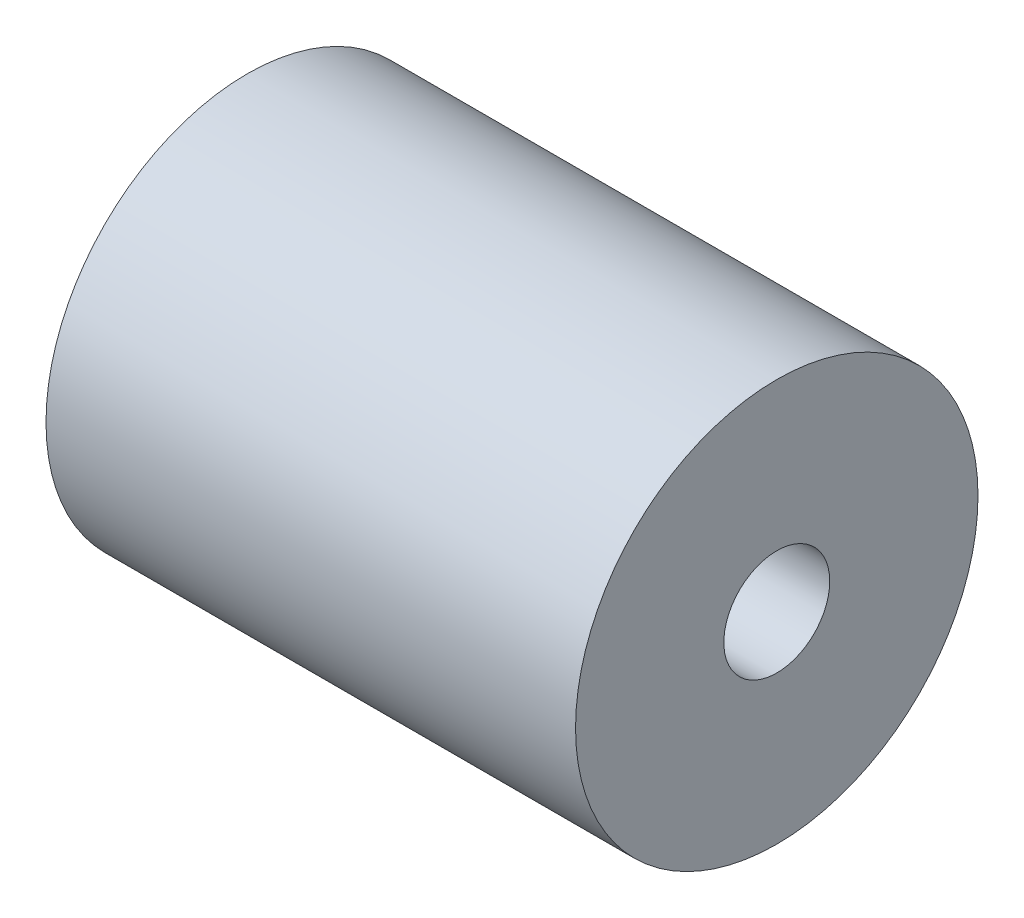
ISO-10303-21;
HEADER;
FILE_DESCRIPTION(('STEP AP214'),'2;1');
FILE_NAME('part.step','',(''),(''),'','','');
FILE_SCHEMA(('AUTOMOTIVE_DESIGN { 1 0 10303 214 1 1 1 1 }'));
ENDSEC;
DATA;
#1=APPLICATION_CONTEXT('core data for automotive mechanical design processes');
#2=APPLICATION_PROTOCOL_DEFINITION('international standard','automotive_design',2000,#1);
#3=PRODUCT_CONTEXT('',#1,'mechanical');
#4=PRODUCT('Part','Part','',(#3));
#5=PRODUCT_RELATED_PRODUCT_CATEGORY('part','',(#4));
#6=PRODUCT_DEFINITION_FORMATION('','',#4);
#7=PRODUCT_DEFINITION_CONTEXT('part definition',#1,'design');
#8=PRODUCT_DEFINITION('design','',#6,#7);
#9=PRODUCT_DEFINITION_SHAPE('','',#8);
#10=(LENGTH_UNIT() NAMED_UNIT(*) SI_UNIT(.MILLI.,.METRE.));
#11=(NAMED_UNIT(*) PLANE_ANGLE_UNIT() SI_UNIT($,.RADIAN.));
#12=(NAMED_UNIT(*) SI_UNIT($,.STERADIAN.) SOLID_ANGLE_UNIT());
#13=UNCERTAINTY_MEASURE_WITH_UNIT(LENGTH_MEASURE(1.E-05),#10,'distance_accuracy_value','');
#14=(GEOMETRIC_REPRESENTATION_CONTEXT(3) GLOBAL_UNCERTAINTY_ASSIGNED_CONTEXT((#13)) GLOBAL_UNIT_ASSIGNED_CONTEXT((#10,
#11,#12)) REPRESENTATION_CONTEXT('',''));
#15=CARTESIAN_POINT('',(0.,0.,0.));
#16=DIRECTION('',(0.,0.,1.));
#17=DIRECTION('',(1.,0.,0.));
#18=AXIS2_PLACEMENT_3D('',#15,#16,#17);
#19=CARTESIAN_POINT('',(25.,0.,0.));
#20=DIRECTION('',(-1.,0.,0.));
#21=DIRECTION('',(0.,0.,1.));
#22=AXIS2_PLACEMENT_3D('',#19,#20,#21);
#23=CYLINDRICAL_SURFACE('',#22,9.5);
#24=CARTESIAN_POINT('',(25.,0.,0.));
#25=DIRECTION('',(1.,0.,0.));
#26=DIRECTION('',(0.,0.,-1.));
#27=AXIS2_PLACEMENT_3D('',#24,#25,#26);
#28=CIRCLE('',#27,9.5);
#29=CARTESIAN_POINT('',(25.,0.,-9.5));
#30=VERTEX_POINT('',#29);
#31=EDGE_CURVE('E10',#30,#30,#28,.T.);
#32=ORIENTED_EDGE('',*,*,#31,.F.);
#33=EDGE_LOOP('',(#32));
#34=FACE_BOUND('',#33,.T.);
#35=CARTESIAN_POINT('',(0.,0.,0.));
#36=DIRECTION('',(1.,0.,0.));
#37=DIRECTION('',(0.,0.,-1.));
#38=AXIS2_PLACEMENT_3D('',#35,#36,#37);
#39=CIRCLE('',#38,9.5);
#40=CARTESIAN_POINT('',(0.,0.,-9.5));
#41=VERTEX_POINT('',#40);
#42=EDGE_CURVE('E33',#41,#41,#39,.T.);
#43=ORIENTED_EDGE('',*,*,#42,.T.);
#44=EDGE_LOOP('',(#43));
#45=FACE_BOUND('',#44,.T.);
#46=ADVANCED_FACE('F30',(#34,#45),#23,.T.);
#47=CARTESIAN_POINT('',(25.,0.,0.));
#48=DIRECTION('',(1.,0.,0.));
#49=DIRECTION('',(0.,0.,-1.));
#50=AXIS2_PLACEMENT_3D('',#47,#48,#49);
#51=PLANE('',#50);
#52=CARTESIAN_POINT('',(25.,0.,0.));
#53=DIRECTION('',(1.,0.,0.));
#54=DIRECTION('',(0.,0.,-1.));
#55=AXIS2_PLACEMENT_3D('',#52,#53,#54);
#56=CIRCLE('',#55,2.5);
#57=CARTESIAN_POINT('',(25.,0.,-2.5));
#58=VERTEX_POINT('',#57);
#59=EDGE_CURVE('E40',#58,#58,#56,.T.);
#60=ORIENTED_EDGE('',*,*,#59,.F.);
#61=EDGE_LOOP('',(#60));
#62=FACE_BOUND('',#61,.T.);
#63=ORIENTED_EDGE('',*,*,#31,.T.);
#64=EDGE_LOOP('',(#63));
#65=FACE_BOUND('',#64,.T.);
#66=ADVANCED_FACE('F67',(#62,#65),#51,.T.);
#67=CARTESIAN_POINT('',(0.,0.,0.));
#68=DIRECTION('',(1.,0.,0.));
#69=DIRECTION('',(0.,0.,-1.));
#70=AXIS2_PLACEMENT_3D('',#67,#68,#69);
#71=PLANE('',#70);
#72=CARTESIAN_POINT('',(0.,0.,0.));
#73=DIRECTION('',(-1.,0.,0.));
#74=DIRECTION('',(0.,0.,1.));
#75=AXIS2_PLACEMENT_3D('',#72,#73,#74);
#76=CIRCLE('',#75,4.);
#77=CARTESIAN_POINT('',(0.,0.,4.));
#78=VERTEX_POINT('',#77);
#79=EDGE_CURVE('E48',#78,#78,#76,.T.);
#80=ORIENTED_EDGE('',*,*,#79,.F.);
#81=EDGE_LOOP('',(#80));
#82=FACE_BOUND('',#81,.T.);
#83=ORIENTED_EDGE('',*,*,#42,.F.);
#84=EDGE_LOOP('',(#83));
#85=FACE_BOUND('',#84,.T.);
#86=ADVANCED_FACE('F63',(#82,#85),#71,.F.);
#87=CARTESIAN_POINT('',(12.5,0.,0.));
#88=DIRECTION('',(1.,0.,0.));
#89=DIRECTION('',(0.,0.,-1.));
#90=AXIS2_PLACEMENT_3D('',#87,#88,#89);
#91=CYLINDRICAL_SURFACE('',#90,2.5);
#92=CARTESIAN_POINT('',(12.5,0.,0.));
#93=DIRECTION('',(-1.,0.,0.));
#94=DIRECTION('',(0.,0.,1.));
#95=AXIS2_PLACEMENT_3D('',#92,#93,#94);
#96=CIRCLE('',#95,2.5);
#97=CARTESIAN_POINT('',(12.5,0.,2.5));
#98=VERTEX_POINT('',#97);
#99=EDGE_CURVE('E44',#98,#98,#96,.F.);
#100=ORIENTED_EDGE('',*,*,#99,.F.);
#101=EDGE_LOOP('',(#100));
#102=FACE_BOUND('',#101,.T.);
#103=ORIENTED_EDGE('',*,*,#59,.T.);
#104=EDGE_LOOP('',(#103));
#105=FACE_BOUND('',#104,.T.);
#106=ADVANCED_FACE('F66',(#102,#105),#91,.F.);
#107=CARTESIAN_POINT('',(12.5,0.,0.));
#108=DIRECTION('',(-1.,0.,0.));
#109=DIRECTION('',(0.,0.,1.));
#110=AXIS2_PLACEMENT_3D('',#107,#108,#109);
#111=PLANE('',#110);
#112=CARTESIAN_POINT('',(12.5,0.,0.));
#113=DIRECTION('',(-1.,0.,0.));
#114=DIRECTION('',(0.,0.,1.));
#115=AXIS2_PLACEMENT_3D('',#112,#113,#114);
#116=CIRCLE('',#115,4.);
#117=CARTESIAN_POINT('',(12.5,0.,4.));
#118=VERTEX_POINT('',#117);
#119=EDGE_CURVE('E47',#118,#118,#116,.T.);
#120=ORIENTED_EDGE('',*,*,#119,.T.);
#121=EDGE_LOOP('',(#120));
#122=FACE_BOUND('',#121,.T.);
#123=ORIENTED_EDGE('',*,*,#99,.T.);
#124=EDGE_LOOP('',(#123));
#125=FACE_BOUND('',#124,.T.);
#126=ADVANCED_FACE('F54',(#122,#125),#111,.T.);
#127=CARTESIAN_POINT('',(12.5,0.,0.));
#128=DIRECTION('',(-1.,0.,0.));
#129=DIRECTION('',(0.,0.,1.));
#130=AXIS2_PLACEMENT_3D('',#127,#128,#129);
#131=CYLINDRICAL_SURFACE('',#130,4.);
#132=ORIENTED_EDGE('',*,*,#119,.F.);
#133=EDGE_LOOP('',(#132));
#134=FACE_BOUND('',#133,.T.);
#135=ORIENTED_EDGE('',*,*,#79,.T.);
#136=EDGE_LOOP('',(#135));
#137=FACE_BOUND('',#136,.T.);
#138=ADVANCED_FACE('F57',(#134,#137),#131,.F.);
#139=CLOSED_SHELL('',(#46,#66,#86,#106,#126,#138));
#140=MANIFOLD_SOLID_BREP('B2',#139);
#141=ADVANCED_BREP_SHAPE_REPRESENTATION('',(#18,#140),#14);
#142=SHAPE_DEFINITION_REPRESENTATION(#9,#141);
ENDSEC;
END-ISO-10303-21;
